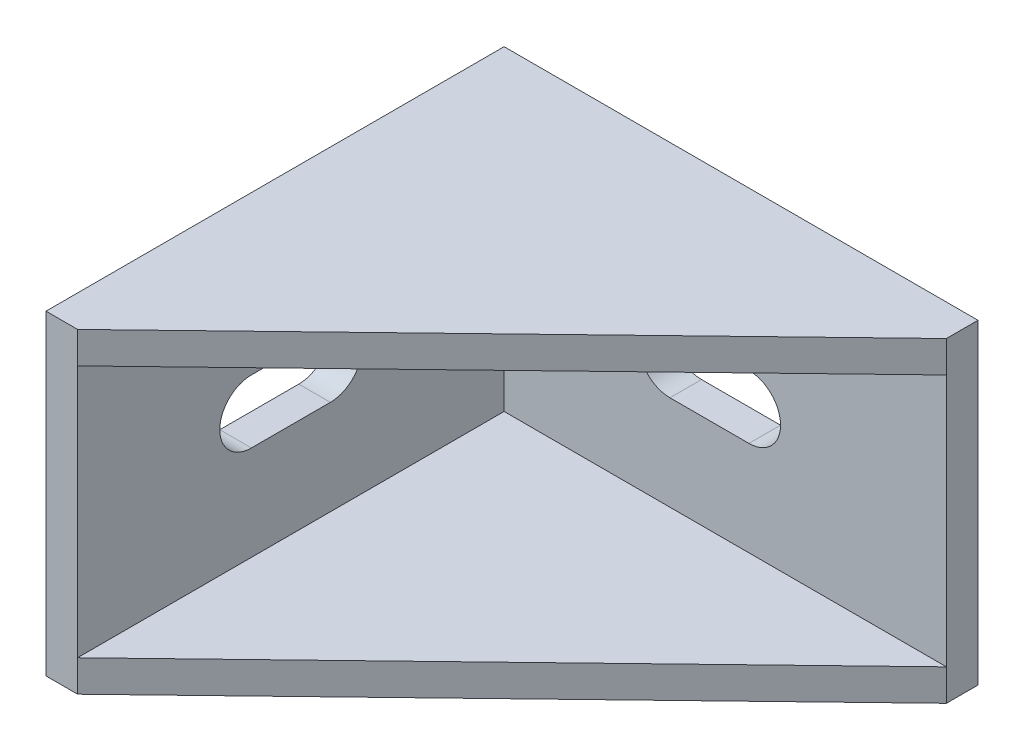
ISO-10303-21;
HEADER;
FILE_DESCRIPTION(('STEP AP214'),'2;1');
FILE_NAME('part.step','',(''),(''),'','','');
FILE_SCHEMA(('AUTOMOTIVE_DESIGN { 1 0 10303 214 1 1 1 1 }'));
ENDSEC;
DATA;
#1=APPLICATION_CONTEXT('core data for automotive mechanical design processes');
#2=APPLICATION_PROTOCOL_DEFINITION('international standard','automotive_design',2000,#1);
#3=PRODUCT_CONTEXT('',#1,'mechanical');
#4=PRODUCT('Part','Part','',(#3));
#5=PRODUCT_RELATED_PRODUCT_CATEGORY('part','',(#4));
#6=PRODUCT_DEFINITION_FORMATION('','',#4);
#7=PRODUCT_DEFINITION_CONTEXT('part definition',#1,'design');
#8=PRODUCT_DEFINITION('design','',#6,#7);
#9=PRODUCT_DEFINITION_SHAPE('','',#8);
#10=(LENGTH_UNIT() NAMED_UNIT(*) SI_UNIT(.MILLI.,.METRE.));
#11=(NAMED_UNIT(*) PLANE_ANGLE_UNIT() SI_UNIT($,.RADIAN.));
#12=(NAMED_UNIT(*) SI_UNIT($,.STERADIAN.) SOLID_ANGLE_UNIT());
#13=UNCERTAINTY_MEASURE_WITH_UNIT(LENGTH_MEASURE(1.E-05),#10,'distance_accuracy_value','');
#14=(GEOMETRIC_REPRESENTATION_CONTEXT(3) GLOBAL_UNCERTAINTY_ASSIGNED_CONTEXT((#13)) GLOBAL_UNIT_ASSIGNED_CONTEXT((#10,
#11,#12)) REPRESENTATION_CONTEXT('',''));
#15=CARTESIAN_POINT('',(0.,0.,0.));
#16=DIRECTION('',(0.,0.,1.));
#17=DIRECTION('',(1.,0.,0.));
#18=AXIS2_PLACEMENT_3D('',#15,#16,#17);
#19=CARTESIAN_POINT('',(0.,0.,0.));
#20=DIRECTION('',(0.,0.,-1.));
#21=DIRECTION('',(-1.,0.,0.));
#22=AXIS2_PLACEMENT_3D('',#19,#20,#21);
#23=PLANE('',#22);
#24=CARTESIAN_POINT('',(-2.5,0.,0.));
#25=DIRECTION('',(0.,0.,-1.));
#26=DIRECTION('',(-1.,0.,0.));
#27=AXIS2_PLACEMENT_3D('',#24,#25,#26);
#28=CIRCLE('',#27,2.);
#29=CARTESIAN_POINT('',(-2.5,-2.,0.));
#30=VERTEX_POINT('',#29);
#31=CARTESIAN_POINT('',(-2.5,2.,0.));
#32=VERTEX_POINT('',#31);
#33=EDGE_CURVE('E398',#30,#32,#28,.T.);
#34=ORIENTED_EDGE('',*,*,#33,.F.);
#35=DIRECTION('',(-1.,0.,0.));
#36=VECTOR('',#35,1.);
#37=CARTESIAN_POINT('',(0.,-2.,0.));
#38=LINE('',#37,#36);
#39=CARTESIAN_POINT('',(2.5,-2.,0.));
#40=VERTEX_POINT('',#39);
#41=EDGE_CURVE('E391',#40,#30,#38,.T.);
#42=ORIENTED_EDGE('',*,*,#41,.F.);
#43=CARTESIAN_POINT('',(2.5,0.,0.));
#44=DIRECTION('',(0.,0.,-1.));
#45=DIRECTION('',(-1.,0.,0.));
#46=AXIS2_PLACEMENT_3D('',#43,#44,#45);
#47=CIRCLE('',#46,2.);
#48=CARTESIAN_POINT('',(2.5,2.,0.));
#49=VERTEX_POINT('',#48);
#50=EDGE_CURVE('E393',#49,#40,#47,.T.);
#51=ORIENTED_EDGE('',*,*,#50,.F.);
#52=DIRECTION('',(1.,0.,0.));
#53=VECTOR('',#52,1.);
#54=CARTESIAN_POINT('',(0.,2.,0.));
#55=LINE('',#54,#53);
#56=EDGE_CURVE('E396',#32,#49,#55,.T.);
#57=ORIENTED_EDGE('',*,*,#56,.F.);
#58=EDGE_LOOP('',(#34,#42,#51,#57));
#59=FACE_BOUND('',#58,.T.);
#60=DIRECTION('',(0.,1.,0.));
#61=VECTOR('',#60,1.);
#62=CARTESIAN_POINT('',(15.,-10.,0.));
#63=LINE('',#62,#61);
#64=CARTESIAN_POINT('',(15.,-10.,0.));
#65=VERTEX_POINT('',#64);
#66=CARTESIAN_POINT('',(15.,10.,0.));
#67=VERTEX_POINT('',#66);
#68=EDGE_CURVE('E365',#65,#67,#63,.T.);
#69=ORIENTED_EDGE('',*,*,#68,.F.);
#70=DIRECTION('',(1.,0.,0.));
#71=VECTOR('',#70,1.);
#72=CARTESIAN_POINT('',(-15.,-10.,0.));
#73=LINE('',#72,#71);
#74=CARTESIAN_POINT('',(-15.,-10.,0.));
#75=VERTEX_POINT('',#74);
#76=EDGE_CURVE('E378',#75,#65,#73,.T.);
#77=ORIENTED_EDGE('',*,*,#76,.F.);
#78=DIRECTION('',(0.,-1.,0.));
#79=VECTOR('',#78,1.);
#80=CARTESIAN_POINT('',(-15.,-10.,0.));
#81=LINE('',#80,#79);
#82=CARTESIAN_POINT('',(-15.,10.,0.));
#83=VERTEX_POINT('',#82);
#84=EDGE_CURVE('E376',#83,#75,#81,.T.);
#85=ORIENTED_EDGE('',*,*,#84,.F.);
#86=DIRECTION('',(-1.,0.,0.));
#87=VECTOR('',#86,1.);
#88=CARTESIAN_POINT('',(-15.,10.,0.));
#89=LINE('',#88,#87);
#90=EDGE_CURVE('E374',#67,#83,#89,.T.);
#91=ORIENTED_EDGE('',*,*,#90,.F.);
#92=EDGE_LOOP('',(#69,#77,#85,#91));
#93=FACE_BOUND('',#92,.T.);
#94=DIRECTION('',(0.,1.,0.));
#95=VECTOR('',#94,1.);
#96=CARTESIAN_POINT('',(7.75,-1.,0.));
#97=LINE('',#96,#95);
#98=CARTESIAN_POINT('',(7.75,-1.,0.));
#99=VERTEX_POINT('',#98);
#100=CARTESIAN_POINT('',(7.75,1.,0.));
#101=VERTEX_POINT('',#100);
#102=EDGE_CURVE('E255',#99,#101,#97,.T.);
#103=ORIENTED_EDGE('',*,*,#102,.F.);
#104=CARTESIAN_POINT('',(9.75,-1.,0.));
#105=DIRECTION('',(0.,0.,-1.));
#106=DIRECTION('',(-1.,0.,0.));
#107=AXIS2_PLACEMENT_3D('',#104,#105,#106);
#108=CIRCLE('',#107,2.);
#109=CARTESIAN_POINT('',(11.75,-1.,0.));
#110=VERTEX_POINT('',#109);
#111=EDGE_CURVE('E230',#110,#99,#108,.T.);
#112=ORIENTED_EDGE('',*,*,#111,.F.);
#113=DIRECTION('',(0.,-1.,0.));
#114=VECTOR('',#113,1.);
#115=CARTESIAN_POINT('',(11.75,-1.,0.));
#116=LINE('',#115,#114);
#117=CARTESIAN_POINT('',(11.75,0.999999999999999,0.));
#118=VERTEX_POINT('',#117);
#119=EDGE_CURVE('E261',#118,#110,#116,.T.);
#120=ORIENTED_EDGE('',*,*,#119,.F.);
#121=CARTESIAN_POINT('',(9.75,1.,0.));
#122=DIRECTION('',(0.,0.,-1.));
#123=DIRECTION('',(-1.,0.,0.));
#124=AXIS2_PLACEMENT_3D('',#121,#122,#123);
#125=CIRCLE('',#124,2.);
#126=EDGE_CURVE('E258',#101,#118,#125,.T.);
#127=ORIENTED_EDGE('',*,*,#126,.F.);
#128=EDGE_LOOP('',(#103,#112,#120,#127));
#129=FACE_BOUND('',#128,.T.);
#130=DIRECTION('',(0.,1.,0.));
#131=VECTOR('',#130,1.);
#132=CARTESIAN_POINT('',(-11.75,-1.,0.));
#133=LINE('',#132,#131);
#134=CARTESIAN_POINT('',(-11.75,-1.,0.));
#135=VERTEX_POINT('',#134);
#136=CARTESIAN_POINT('',(-11.75,1.,0.));
#137=VERTEX_POINT('',#136);
#138=EDGE_CURVE('E226',#135,#137,#133,.T.);
#139=ORIENTED_EDGE('',*,*,#138,.F.);
#140=CARTESIAN_POINT('',(-9.75,-1.,0.));
#141=DIRECTION('',(0.,0.,-1.));
#142=DIRECTION('',(-1.,0.,0.));
#143=AXIS2_PLACEMENT_3D('',#140,#141,#142);
#144=CIRCLE('',#143,2.);
#145=CARTESIAN_POINT('',(-7.75,-1.,0.));
#146=VERTEX_POINT('',#145);
#147=EDGE_CURVE('E234',#146,#135,#144,.T.);
#148=ORIENTED_EDGE('',*,*,#147,.F.);
#149=DIRECTION('',(0.,-1.,0.));
#150=VECTOR('',#149,1.);
#151=CARTESIAN_POINT('',(-7.75,-1.,0.));
#152=LINE('',#151,#150);
#153=CARTESIAN_POINT('',(-7.75,1.,0.));
#154=VERTEX_POINT('',#153);
#155=EDGE_CURVE('E245',#154,#146,#152,.T.);
#156=ORIENTED_EDGE('',*,*,#155,.F.);
#157=CARTESIAN_POINT('',(-9.75,1.,0.));
#158=DIRECTION('',(0.,0.,-1.));
#159=DIRECTION('',(-1.,0.,0.));
#160=AXIS2_PLACEMENT_3D('',#157,#158,#159);
#161=CIRCLE('',#160,2.);
#162=EDGE_CURVE('E243',#137,#154,#161,.T.);
#163=ORIENTED_EDGE('',*,*,#162,.F.);
#164=EDGE_LOOP('',(#139,#148,#156,#163));
#165=FACE_BOUND('',#164,.T.);
#166=ADVANCED_FACE('F35',(#59,#93,#129,#165),#23,.T.);
#167=CARTESIAN_POINT('',(0.,0.,2.));
#168=DIRECTION('',(0.,0.,-1.));
#169=DIRECTION('',(-1.,0.,0.));
#170=AXIS2_PLACEMENT_3D('',#167,#168,#169);
#171=PLANE('',#170);
#172=DIRECTION('',(1.,0.,0.));
#173=VECTOR('',#172,1.);
#174=CARTESIAN_POINT('',(-2.5,-2.,2.));
#175=LINE('',#174,#173);
#176=CARTESIAN_POINT('',(-2.5,-2.,2.));
#177=VERTEX_POINT('',#176);
#178=CARTESIAN_POINT('',(2.5,-2.,2.));
#179=VERTEX_POINT('',#178);
#180=EDGE_CURVE('E334',#177,#179,#175,.T.);
#181=ORIENTED_EDGE('',*,*,#180,.F.);
#182=CARTESIAN_POINT('',(-2.5,0.,2.));
#183=DIRECTION('',(0.,0.,1.));
#184=DIRECTION('',(1.,0.,0.));
#185=AXIS2_PLACEMENT_3D('',#182,#183,#184);
#186=CIRCLE('',#185,2.);
#187=CARTESIAN_POINT('',(-2.5,2.,2.));
#188=VERTEX_POINT('',#187);
#189=EDGE_CURVE('E332',#188,#177,#186,.T.);
#190=ORIENTED_EDGE('',*,*,#189,.F.);
#191=DIRECTION('',(-1.,0.,0.));
#192=VECTOR('',#191,1.);
#193=CARTESIAN_POINT('',(-2.5,2.,2.));
#194=LINE('',#193,#192);
#195=CARTESIAN_POINT('',(2.5,2.,2.));
#196=VERTEX_POINT('',#195);
#197=EDGE_CURVE('E340',#196,#188,#194,.T.);
#198=ORIENTED_EDGE('',*,*,#197,.F.);
#199=CARTESIAN_POINT('',(2.5,0.,2.));
#200=DIRECTION('',(0.,0.,1.));
#201=DIRECTION('',(1.,0.,0.));
#202=AXIS2_PLACEMENT_3D('',#199,#200,#201);
#203=CIRCLE('',#202,2.);
#204=EDGE_CURVE('E337',#179,#196,#203,.T.);
#205=ORIENTED_EDGE('',*,*,#204,.F.);
#206=EDGE_LOOP('',(#181,#190,#198,#205));
#207=FACE_BOUND('',#206,.T.);
#208=DIRECTION('',(-1.,0.,0.));
#209=VECTOR('',#208,1.);
#210=CARTESIAN_POINT('',(-13.,8.,2.));
#211=LINE('',#210,#209);
#212=CARTESIAN_POINT('',(15.,8.,2.));
#213=VERTEX_POINT('',#212);
#214=CARTESIAN_POINT('',(-13.,8.,2.));
#215=VERTEX_POINT('',#214);
#216=EDGE_CURVE('E273',#213,#215,#211,.T.);
#217=ORIENTED_EDGE('',*,*,#216,.T.);
#218=DIRECTION('',(0.,-1.,0.));
#219=VECTOR('',#218,1.);
#220=CARTESIAN_POINT('',(-13.,0.,2.));
#221=LINE('',#220,#219);
#222=CARTESIAN_POINT('',(-13.,-8.,2.));
#223=VERTEX_POINT('',#222);
#224=EDGE_CURVE('E346',#215,#223,#221,.T.);
#225=ORIENTED_EDGE('',*,*,#224,.T.);
#226=DIRECTION('',(1.,0.,0.));
#227=VECTOR('',#226,1.);
#228=CARTESIAN_POINT('',(-13.,-8.,2.));
#229=LINE('',#228,#227);
#230=CARTESIAN_POINT('',(15.,-8.,2.));
#231=VERTEX_POINT('',#230);
#232=EDGE_CURVE('E290',#223,#231,#229,.T.);
#233=ORIENTED_EDGE('',*,*,#232,.T.);
#234=DIRECTION('',(0.,1.,0.));
#235=VECTOR('',#234,1.);
#236=CARTESIAN_POINT('',(15.,-10.,2.));
#237=LINE('',#236,#235);
#238=EDGE_CURVE('E371',#231,#213,#237,.T.);
#239=ORIENTED_EDGE('',*,*,#238,.T.);
#240=EDGE_LOOP('',(#217,#225,#233,#239));
#241=FACE_BOUND('',#240,.T.);
#242=ADVANCED_FACE('F478',(#207,#241),#171,.F.);
#243=CARTESIAN_POINT('',(-13.,0.,29.));
#244=DIRECTION('',(1.,0.,0.));
#245=DIRECTION('',(0.,1.,0.));
#246=AXIS2_PLACEMENT_3D('',#243,#244,#245);
#247=PLANE('',#246);
#248=CARTESIAN_POINT('',(-13.,0.,18.));
#249=DIRECTION('',(1.,0.,0.));
#250=DIRECTION('',(0.,1.,0.));
#251=AXIS2_PLACEMENT_3D('',#248,#249,#250);
#252=CIRCLE('',#251,2.);
#253=CARTESIAN_POINT('',(-13.,2.,18.));
#254=VERTEX_POINT('',#253);
#255=CARTESIAN_POINT('',(-13.,-2.,18.));
#256=VERTEX_POINT('',#255);
#257=EDGE_CURVE('E300',#254,#256,#252,.T.);
#258=ORIENTED_EDGE('',*,*,#257,.F.);
#259=DIRECTION('',(0.,0.,1.));
#260=VECTOR('',#259,1.);
#261=CARTESIAN_POINT('',(-13.,2.,18.));
#262=LINE('',#261,#260);
#263=CARTESIAN_POINT('',(-13.,2.,13.));
#264=VERTEX_POINT('',#263);
#265=EDGE_CURVE('E308',#264,#254,#262,.T.);
#266=ORIENTED_EDGE('',*,*,#265,.F.);
#267=CARTESIAN_POINT('',(-13.,0.,13.));
#268=DIRECTION('',(1.,0.,0.));
#269=DIRECTION('',(0.,1.,0.));
#270=AXIS2_PLACEMENT_3D('',#267,#268,#269);
#271=CIRCLE('',#270,2.);
#272=CARTESIAN_POINT('',(-13.,-2.,13.));
#273=VERTEX_POINT('',#272);
#274=EDGE_CURVE('E305',#273,#264,#271,.T.);
#275=ORIENTED_EDGE('',*,*,#274,.F.);
#276=DIRECTION('',(0.,0.,-1.));
#277=VECTOR('',#276,1.);
#278=CARTESIAN_POINT('',(-13.,-2.,18.));
#279=LINE('',#278,#277);
#280=EDGE_CURVE('E302',#256,#273,#279,.T.);
#281=ORIENTED_EDGE('',*,*,#280,.F.);
#282=EDGE_LOOP('',(#258,#266,#275,#281));
#283=FACE_BOUND('',#282,.T.);
#284=ORIENTED_EDGE('',*,*,#224,.F.);
#285=DIRECTION('',(0.,0.,1.));
#286=VECTOR('',#285,1.);
#287=CARTESIAN_POINT('',(-13.,8.,29.));
#288=LINE('',#287,#286);
#289=CARTESIAN_POINT('',(-13.,8.,29.));
#290=VERTEX_POINT('',#289);
#291=EDGE_CURVE('E275',#215,#290,#288,.T.);
#292=ORIENTED_EDGE('',*,*,#291,.T.);
#293=DIRECTION('',(0.,-1.,0.));
#294=VECTOR('',#293,1.);
#295=CARTESIAN_POINT('',(-13.,0.,29.));
#296=LINE('',#295,#294);
#297=CARTESIAN_POINT('',(-13.,-8.,29.));
#298=VERTEX_POINT('',#297);
#299=EDGE_CURVE('E357',#290,#298,#296,.T.);
#300=ORIENTED_EDGE('',*,*,#299,.T.);
#301=DIRECTION('',(0.,0.,-1.));
#302=VECTOR('',#301,1.);
#303=CARTESIAN_POINT('',(-13.,-8.,29.));
#304=LINE('',#303,#302);
#305=EDGE_CURVE('E287',#298,#223,#304,.T.);
#306=ORIENTED_EDGE('',*,*,#305,.T.);
#307=EDGE_LOOP('',(#284,#292,#300,#306));
#308=FACE_BOUND('',#307,.T.);
#309=ADVANCED_FACE('F484',(#283,#308),#247,.T.);
#310=CARTESIAN_POINT('',(15.,-10.,2.));
#311=DIRECTION('',(-1.,0.,0.));
#312=DIRECTION('',(0.,0.,1.));
#313=AXIS2_PLACEMENT_3D('',#310,#311,#312);
#314=PLANE('',#313);
#315=ORIENTED_EDGE('',*,*,#68,.T.);
#316=DIRECTION('',(0.,0.,-1.));
#317=VECTOR('',#316,1.);
#318=CARTESIAN_POINT('',(15.,10.,2.));
#319=LINE('',#318,#317);
#320=CARTESIAN_POINT('',(15.,10.,2.));
#321=VERTEX_POINT('',#320);
#322=EDGE_CURVE('E388',#321,#67,#319,.T.);
#323=ORIENTED_EDGE('',*,*,#322,.F.);
#324=DIRECTION('',(0.,1.,0.));
#325=VECTOR('',#324,1.);
#326=CARTESIAN_POINT('',(15.,8.,2.));
#327=LINE('',#326,#325);
#328=EDGE_CURVE('E281',#213,#321,#327,.T.);
#329=ORIENTED_EDGE('',*,*,#328,.F.);
#330=ORIENTED_EDGE('',*,*,#238,.F.);
#331=CARTESIAN_POINT('',(15.,-10.,2.));
#332=VERTEX_POINT('',#331);
#333=EDGE_CURVE('E367',#332,#231,#237,.T.);
#334=ORIENTED_EDGE('',*,*,#333,.F.);
#335=DIRECTION('',(0.,0.,-1.));
#336=VECTOR('',#335,1.);
#337=CARTESIAN_POINT('',(15.,-10.,2.));
#338=LINE('',#337,#336);
#339=EDGE_CURVE('E370',#332,#65,#338,.T.);
#340=ORIENTED_EDGE('',*,*,#339,.T.);
#341=EDGE_LOOP('',(#315,#323,#329,#330,#334,#340));
#342=FACE_BOUND('',#341,.T.);
#343=ADVANCED_FACE('F503',(#342),#314,.F.);
#344=CARTESIAN_POINT('',(-15.,10.,2.));
#345=DIRECTION('',(0.,-1.,0.));
#346=DIRECTION('',(0.,0.,-1.));
#347=AXIS2_PLACEMENT_3D('',#344,#345,#346);
#348=PLANE('',#347);
#349=ORIENTED_EDGE('',*,*,#90,.T.);
#350=DIRECTION('',(0.,0.,-1.));
#351=VECTOR('',#350,1.);
#352=CARTESIAN_POINT('',(-15.,10.,2.));
#353=LINE('',#352,#351);
#354=CARTESIAN_POINT('',(-15.,10.,29.));
#355=VERTEX_POINT('',#354);
#356=EDGE_CURVE('E385',#355,#83,#353,.T.);
#357=ORIENTED_EDGE('',*,*,#356,.F.);
#358=DIRECTION('',(-1.,0.,0.));
#359=VECTOR('',#358,1.);
#360=CARTESIAN_POINT('',(0.,10.,29.));
#361=LINE('',#360,#359);
#362=CARTESIAN_POINT('',(-13.,10.,29.));
#363=VERTEX_POINT('',#362);
#364=EDGE_CURVE('E356',#363,#355,#361,.T.);
#365=ORIENTED_EDGE('',*,*,#364,.F.);
#366=DIRECTION('',(0.719844295420685,0.,-0.694135570584232));
#367=VECTOR('',#366,1.);
#368=CARTESIAN_POINT('',(15.,10.,2.));
#369=LINE('',#368,#367);
#370=EDGE_CURVE('E272',#363,#321,#369,.T.);
#371=ORIENTED_EDGE('',*,*,#370,.T.);
#372=ORIENTED_EDGE('',*,*,#322,.T.);
#373=EDGE_LOOP('',(#349,#357,#365,#371,#372));
#374=FACE_BOUND('',#373,.T.);
#375=ADVANCED_FACE('F499',(#374),#348,.F.);
#376=CARTESIAN_POINT('',(-15.,-10.,2.));
#377=DIRECTION('',(1.,0.,0.));
#378=DIRECTION('',(0.,0.,-1.));
#379=AXIS2_PLACEMENT_3D('',#376,#377,#378);
#380=PLANE('',#379);
#381=DIRECTION('',(0.,0.,1.));
#382=VECTOR('',#381,1.);
#383=CARTESIAN_POINT('',(-15.,2.,2.));
#384=LINE('',#383,#382);
#385=CARTESIAN_POINT('',(-15.,2.,13.));
#386=VERTEX_POINT('',#385);
#387=CARTESIAN_POINT('',(-15.,2.,18.));
#388=VERTEX_POINT('',#387);
#389=EDGE_CURVE('E326',#386,#388,#384,.T.);
#390=ORIENTED_EDGE('',*,*,#389,.T.);
#391=CARTESIAN_POINT('',(-15.,0.,18.));
#392=DIRECTION('',(1.,0.,0.));
#393=DIRECTION('',(0.,0.,-1.));
#394=AXIS2_PLACEMENT_3D('',#391,#392,#393);
#395=CIRCLE('',#394,2.);
#396=CARTESIAN_POINT('',(-15.,-2.,18.));
#397=VERTEX_POINT('',#396);
#398=EDGE_CURVE('E329',#388,#397,#395,.T.);
#399=ORIENTED_EDGE('',*,*,#398,.T.);
#400=DIRECTION('',(0.,0.,-1.));
#401=VECTOR('',#400,1.);
#402=CARTESIAN_POINT('',(-15.,-2.,2.));
#403=LINE('',#402,#401);
#404=CARTESIAN_POINT('',(-15.,-2.,13.));
#405=VERTEX_POINT('',#404);
#406=EDGE_CURVE('E314',#397,#405,#403,.T.);
#407=ORIENTED_EDGE('',*,*,#406,.T.);
#408=CARTESIAN_POINT('',(-15.,0.,13.));
#409=DIRECTION('',(1.,0.,0.));
#410=DIRECTION('',(0.,0.,-1.));
#411=AXIS2_PLACEMENT_3D('',#408,#409,#410);
#412=CIRCLE('',#411,2.);
#413=EDGE_CURVE('E323',#405,#386,#412,.T.);
#414=ORIENTED_EDGE('',*,*,#413,.T.);
#415=EDGE_LOOP('',(#390,#399,#407,#414));
#416=FACE_BOUND('',#415,.T.);
#417=ORIENTED_EDGE('',*,*,#84,.T.);
#418=DIRECTION('',(0.,0.,-1.));
#419=VECTOR('',#418,1.);
#420=CARTESIAN_POINT('',(-15.,-10.,2.));
#421=LINE('',#420,#419);
#422=CARTESIAN_POINT('',(-15.,-10.,29.));
#423=VERTEX_POINT('',#422);
#424=EDGE_CURVE('E382',#423,#75,#421,.T.);
#425=ORIENTED_EDGE('',*,*,#424,.F.);
#426=DIRECTION('',(0.,-1.,0.));
#427=VECTOR('',#426,1.);
#428=CARTESIAN_POINT('',(-15.,0.,29.));
#429=LINE('',#428,#427);
#430=EDGE_CURVE('E360',#355,#423,#429,.T.);
#431=ORIENTED_EDGE('',*,*,#430,.F.);
#432=ORIENTED_EDGE('',*,*,#356,.T.);
#433=EDGE_LOOP('',(#417,#425,#431,#432));
#434=FACE_BOUND('',#433,.T.);
#435=ADVANCED_FACE('F495',(#416,#434),#380,.F.);
#436=CARTESIAN_POINT('',(-15.,-10.,2.));
#437=DIRECTION('',(0.,1.,0.));
#438=DIRECTION('',(0.,0.,1.));
#439=AXIS2_PLACEMENT_3D('',#436,#437,#438);
#440=PLANE('',#439);
#441=ORIENTED_EDGE('',*,*,#339,.F.);
#442=DIRECTION('',(-0.719844295420685,0.,0.694135570584232));
#443=VECTOR('',#442,1.);
#444=CARTESIAN_POINT('',(-13.,-10.,29.));
#445=LINE('',#444,#443);
#446=CARTESIAN_POINT('',(-13.,-10.,29.));
#447=VERTEX_POINT('',#446);
#448=EDGE_CURVE('E286',#332,#447,#445,.T.);
#449=ORIENTED_EDGE('',*,*,#448,.T.);
#450=DIRECTION('',(1.,0.,0.));
#451=VECTOR('',#450,1.);
#452=CARTESIAN_POINT('',(0.,-10.,29.));
#453=LINE('',#452,#451);
#454=EDGE_CURVE('E363',#423,#447,#453,.T.);
#455=ORIENTED_EDGE('',*,*,#454,.F.);
#456=ORIENTED_EDGE('',*,*,#424,.T.);
#457=ORIENTED_EDGE('',*,*,#76,.T.);
#458=EDGE_LOOP('',(#441,#449,#455,#456,#457));
#459=FACE_BOUND('',#458,.T.);
#460=ADVANCED_FACE('F491',(#459),#440,.F.);
#461=CARTESIAN_POINT('',(0.,0.,29.));
#462=DIRECTION('',(0.,0.,1.));
#463=DIRECTION('',(1.,0.,0.));
#464=AXIS2_PLACEMENT_3D('',#461,#462,#463);
#465=PLANE('',#464);
#466=EDGE_CURVE('E353',#363,#290,#296,.T.);
#467=ORIENTED_EDGE('',*,*,#466,.F.);
#468=ORIENTED_EDGE('',*,*,#364,.T.);
#469=ORIENTED_EDGE('',*,*,#430,.T.);
#470=ORIENTED_EDGE('',*,*,#454,.T.);
#471=DIRECTION('',(0.,-1.,0.));
#472=VECTOR('',#471,1.);
#473=CARTESIAN_POINT('',(-13.,-8.,29.));
#474=LINE('',#473,#472);
#475=EDGE_CURVE('E295',#298,#447,#474,.T.);
#476=ORIENTED_EDGE('',*,*,#475,.F.);
#477=ORIENTED_EDGE('',*,*,#299,.F.);
#478=EDGE_LOOP('',(#467,#468,#469,#470,#476,#477));
#479=FACE_BOUND('',#478,.T.);
#480=ADVANCED_FACE('F494',(#479),#465,.T.);
#481=CARTESIAN_POINT('',(-2.5,0.,-25.));
#482=DIRECTION('',(0.,0.,1.));
#483=DIRECTION('',(1.,0.,0.));
#484=AXIS2_PLACEMENT_3D('',#481,#482,#483);
#485=CYLINDRICAL_SURFACE('',#484,2.);
#486=ORIENTED_EDGE('',*,*,#33,.T.);
#487=DIRECTION('',(0.,0.,1.));
#488=VECTOR('',#487,1.);
#489=CARTESIAN_POINT('',(-2.5,2.,-25.));
#490=LINE('',#489,#488);
#491=EDGE_CURVE('E344',#32,#188,#490,.T.);
#492=ORIENTED_EDGE('',*,*,#491,.T.);
#493=ORIENTED_EDGE('',*,*,#189,.T.);
#494=DIRECTION('',(0.,0.,1.));
#495=VECTOR('',#494,1.);
#496=CARTESIAN_POINT('',(-2.5,-2.,-25.));
#497=LINE('',#496,#495);
#498=EDGE_CURVE('E343',#30,#177,#497,.T.);
#499=ORIENTED_EDGE('',*,*,#498,.F.);
#500=EDGE_LOOP('',(#486,#492,#493,#499));
#501=FACE_BOUND('',#500,.T.);
#502=ADVANCED_FACE('F634',(#501),#485,.F.);
#503=CARTESIAN_POINT('',(-2.5,2.,-25.));
#504=DIRECTION('',(0.,1.,0.));
#505=DIRECTION('',(0.,0.,1.));
#506=AXIS2_PLACEMENT_3D('',#503,#504,#505);
#507=PLANE('',#506);
#508=ORIENTED_EDGE('',*,*,#56,.T.);
#509=DIRECTION('',(0.,0.,1.));
#510=VECTOR('',#509,1.);
#511=CARTESIAN_POINT('',(2.5,2.,-25.));
#512=LINE('',#511,#510);
#513=EDGE_CURVE('E347',#49,#196,#512,.T.);
#514=ORIENTED_EDGE('',*,*,#513,.T.);
#515=ORIENTED_EDGE('',*,*,#197,.T.);
#516=ORIENTED_EDGE('',*,*,#491,.F.);
#517=EDGE_LOOP('',(#508,#514,#515,#516));
#518=FACE_BOUND('',#517,.T.);
#519=ADVANCED_FACE('F757',(#518),#507,.F.);
#520=CARTESIAN_POINT('',(2.5,0.,-25.));
#521=DIRECTION('',(0.,0.,1.));
#522=DIRECTION('',(1.,0.,0.));
#523=AXIS2_PLACEMENT_3D('',#520,#521,#522);
#524=CYLINDRICAL_SURFACE('',#523,2.);
#525=ORIENTED_EDGE('',*,*,#50,.T.);
#526=DIRECTION('',(0.,0.,1.));
#527=VECTOR('',#526,1.);
#528=CARTESIAN_POINT('',(2.5,-2.,-25.));
#529=LINE('',#528,#527);
#530=EDGE_CURVE('E349',#40,#179,#529,.T.);
#531=ORIENTED_EDGE('',*,*,#530,.T.);
#532=ORIENTED_EDGE('',*,*,#204,.T.);
#533=ORIENTED_EDGE('',*,*,#513,.F.);
#534=EDGE_LOOP('',(#525,#531,#532,#533));
#535=FACE_BOUND('',#534,.T.);
#536=ADVANCED_FACE('F747',(#535),#524,.F.);
#537=CARTESIAN_POINT('',(-2.5,-2.,-25.));
#538=DIRECTION('',(0.,-1.,0.));
#539=DIRECTION('',(0.,0.,-1.));
#540=AXIS2_PLACEMENT_3D('',#537,#538,#539);
#541=PLANE('',#540);
#542=ORIENTED_EDGE('',*,*,#41,.T.);
#543=ORIENTED_EDGE('',*,*,#498,.T.);
#544=ORIENTED_EDGE('',*,*,#180,.T.);
#545=ORIENTED_EDGE('',*,*,#530,.F.);
#546=EDGE_LOOP('',(#542,#543,#544,#545));
#547=FACE_BOUND('',#546,.T.);
#548=ADVANCED_FACE('F729',(#547),#541,.F.);
#549=CARTESIAN_POINT('',(-40.,0.,18.));
#550=DIRECTION('',(1.,0.,0.));
#551=DIRECTION('',(0.,1.,0.));
#552=AXIS2_PLACEMENT_3D('',#549,#550,#551);
#553=CYLINDRICAL_SURFACE('',#552,2.);
#554=DIRECTION('',(1.,0.,0.));
#555=VECTOR('',#554,1.);
#556=CARTESIAN_POINT('',(-40.,1.99999999999999,18.));
#557=LINE('',#556,#555);
#558=EDGE_CURVE('E312',#388,#254,#557,.T.);
#559=ORIENTED_EDGE('',*,*,#558,.T.);
#560=ORIENTED_EDGE('',*,*,#257,.T.);
#561=DIRECTION('',(1.,0.,0.));
#562=VECTOR('',#561,1.);
#563=CARTESIAN_POINT('',(-40.,-2.00000000000001,18.));
#564=LINE('',#563,#562);
#565=EDGE_CURVE('E311',#397,#256,#564,.T.);
#566=ORIENTED_EDGE('',*,*,#565,.F.);
#567=ORIENTED_EDGE('',*,*,#398,.F.);
#568=EDGE_LOOP('',(#559,#560,#566,#567));
#569=FACE_BOUND('',#568,.T.);
#570=ADVANCED_FACE('F719',(#569),#553,.F.);
#571=CARTESIAN_POINT('',(-40.,1.99999999999999,18.));
#572=DIRECTION('',(0.,1.,0.));
#573=DIRECTION('',(0.,0.,1.));
#574=AXIS2_PLACEMENT_3D('',#571,#572,#573);
#575=PLANE('',#574);
#576=DIRECTION('',(1.,0.,0.));
#577=VECTOR('',#576,1.);
#578=CARTESIAN_POINT('',(-40.,1.99999999999999,13.));
#579=LINE('',#578,#577);
#580=EDGE_CURVE('E315',#386,#264,#579,.T.);
#581=ORIENTED_EDGE('',*,*,#580,.T.);
#582=ORIENTED_EDGE('',*,*,#265,.T.);
#583=ORIENTED_EDGE('',*,*,#558,.F.);
#584=ORIENTED_EDGE('',*,*,#389,.F.);
#585=EDGE_LOOP('',(#581,#582,#583,#584));
#586=FACE_BOUND('',#585,.T.);
#587=ADVANCED_FACE('F709',(#586),#575,.F.);
#588=CARTESIAN_POINT('',(-40.,0.,13.));
#589=DIRECTION('',(1.,0.,0.));
#590=DIRECTION('',(0.,1.,0.));
#591=AXIS2_PLACEMENT_3D('',#588,#589,#590);
#592=CYLINDRICAL_SURFACE('',#591,2.);
#593=DIRECTION('',(1.,0.,0.));
#594=VECTOR('',#593,1.);
#595=CARTESIAN_POINT('',(-40.,-2.00000000000001,13.));
#596=LINE('',#595,#594);
#597=EDGE_CURVE('E317',#405,#273,#596,.T.);
#598=ORIENTED_EDGE('',*,*,#597,.T.);
#599=ORIENTED_EDGE('',*,*,#274,.T.);
#600=ORIENTED_EDGE('',*,*,#580,.F.);
#601=ORIENTED_EDGE('',*,*,#413,.F.);
#602=EDGE_LOOP('',(#598,#599,#600,#601));
#603=FACE_BOUND('',#602,.T.);
#604=ADVANCED_FACE('F699',(#603),#592,.F.);
#605=CARTESIAN_POINT('',(-40.,-2.00000000000001,18.));
#606=DIRECTION('',(0.,-1.,0.));
#607=DIRECTION('',(0.,0.,-1.));
#608=AXIS2_PLACEMENT_3D('',#605,#606,#607);
#609=PLANE('',#608);
#610=ORIENTED_EDGE('',*,*,#565,.T.);
#611=ORIENTED_EDGE('',*,*,#280,.T.);
#612=ORIENTED_EDGE('',*,*,#597,.F.);
#613=ORIENTED_EDGE('',*,*,#406,.F.);
#614=EDGE_LOOP('',(#610,#611,#612,#613));
#615=FACE_BOUND('',#614,.T.);
#616=ADVANCED_FACE('F683',(#615),#609,.F.);
#617=CARTESIAN_POINT('',(-13.,-8.,29.));
#618=DIRECTION('',(0.694135570584232,0.,0.719844295420685));
#619=DIRECTION('',(0.719844295420685,0.,-0.694135570584232));
#620=AXIS2_PLACEMENT_3D('',#617,#618,#619);
#621=PLANE('',#620);
#622=ORIENTED_EDGE('',*,*,#448,.F.);
#623=ORIENTED_EDGE('',*,*,#333,.T.);
#624=DIRECTION('',(-0.719844295420685,0.,0.694135570584232));
#625=VECTOR('',#624,1.);
#626=CARTESIAN_POINT('',(-13.,-8.,29.));
#627=LINE('',#626,#625);
#628=EDGE_CURVE('E292',#231,#298,#627,.T.);
#629=ORIENTED_EDGE('',*,*,#628,.T.);
#630=ORIENTED_EDGE('',*,*,#475,.T.);
#631=EDGE_LOOP('',(#622,#623,#629,#630));
#632=FACE_BOUND('',#631,.T.);
#633=ADVANCED_FACE('F673',(#632),#621,.T.);
#634=CARTESIAN_POINT('',(0.,-8.,0.));
#635=DIRECTION('',(0.,-1.,0.));
#636=DIRECTION('',(0.,0.,-1.));
#637=AXIS2_PLACEMENT_3D('',#634,#635,#636);
#638=PLANE('',#637);
#639=ORIENTED_EDGE('',*,*,#305,.F.);
#640=ORIENTED_EDGE('',*,*,#628,.F.);
#641=ORIENTED_EDGE('',*,*,#232,.F.);
#642=EDGE_LOOP('',(#639,#640,#641));
#643=FACE_BOUND('',#642,.T.);
#644=ADVANCED_FACE('F622',(#643),#638,.F.);
#645=CARTESIAN_POINT('',(15.,8.,2.));
#646=DIRECTION('',(0.694135570584232,0.,0.719844295420685));
#647=DIRECTION('',(0.719844295420685,0.,-0.694135570584232));
#648=AXIS2_PLACEMENT_3D('',#645,#646,#647);
#649=PLANE('',#648);
#650=ORIENTED_EDGE('',*,*,#370,.F.);
#651=ORIENTED_EDGE('',*,*,#466,.T.);
#652=DIRECTION('',(0.719844295420685,0.,-0.694135570584232));
#653=VECTOR('',#652,1.);
#654=CARTESIAN_POINT('',(15.,8.,2.));
#655=LINE('',#654,#653);
#656=EDGE_CURVE('E278',#290,#213,#655,.T.);
#657=ORIENTED_EDGE('',*,*,#656,.T.);
#658=ORIENTED_EDGE('',*,*,#328,.T.);
#659=EDGE_LOOP('',(#650,#651,#657,#658));
#660=FACE_BOUND('',#659,.T.);
#661=ADVANCED_FACE('F612',(#660),#649,.T.);
#662=CARTESIAN_POINT('',(0.,8.,0.));
#663=DIRECTION('',(0.,1.,0.));
#664=DIRECTION('',(0.,0.,1.));
#665=AXIS2_PLACEMENT_3D('',#662,#663,#664);
#666=PLANE('',#665);
#667=ORIENTED_EDGE('',*,*,#216,.F.);
#668=ORIENTED_EDGE('',*,*,#656,.F.);
#669=ORIENTED_EDGE('',*,*,#291,.F.);
#670=EDGE_LOOP('',(#667,#668,#669));
#671=FACE_BOUND('',#670,.T.);
#672=ADVANCED_FACE('F597',(#671),#666,.F.);
#673=CARTESIAN_POINT('',(9.75,-1.,-3.));
#674=DIRECTION('',(0.,0.,1.));
#675=DIRECTION('',(1.,0.,0.));
#676=AXIS2_PLACEMENT_3D('',#673,#674,#675);
#677=CYLINDRICAL_SURFACE('',#676,2.);
#678=DIRECTION('',(0.,0.,1.));
#679=VECTOR('',#678,1.);
#680=CARTESIAN_POINT('',(7.75,-1.,-3.));
#681=LINE('',#680,#679);
#682=CARTESIAN_POINT('',(7.75,-1.,-2.5));
#683=VERTEX_POINT('',#682);
#684=EDGE_CURVE('E270',#683,#99,#681,.T.);
#685=ORIENTED_EDGE('',*,*,#684,.F.);
#686=CARTESIAN_POINT('',(9.75,-1.,-2.5));
#687=DIRECTION('',(0.,0.,-1.));
#688=DIRECTION('',(-1.,0.,0.));
#689=AXIS2_PLACEMENT_3D('',#686,#687,#688);
#690=CIRCLE('',#689,2.);
#691=CARTESIAN_POINT('',(11.75,-1.,-2.5));
#692=VERTEX_POINT('',#691);
#693=EDGE_CURVE('E412',#683,#692,#690,.F.);
#694=ORIENTED_EDGE('',*,*,#693,.T.);
#695=DIRECTION('',(0.,0.,1.));
#696=VECTOR('',#695,1.);
#697=CARTESIAN_POINT('',(11.75,-1.,-3.));
#698=LINE('',#697,#696);
#699=EDGE_CURVE('E264',#692,#110,#698,.T.);
#700=ORIENTED_EDGE('',*,*,#699,.T.);
#701=ORIENTED_EDGE('',*,*,#111,.T.);
#702=EDGE_LOOP('',(#685,#694,#700,#701));
#703=FACE_BOUND('',#702,.T.);
#704=ADVANCED_FACE('F588',(#703),#677,.T.);
#705=CARTESIAN_POINT('',(7.75,-1.,-3.));
#706=DIRECTION('',(1.,0.,0.));
#707=DIRECTION('',(0.,0.,-1.));
#708=AXIS2_PLACEMENT_3D('',#705,#706,#707);
#709=PLANE('',#708);
#710=DIRECTION('',(0.,0.,1.));
#711=VECTOR('',#710,1.);
#712=CARTESIAN_POINT('',(7.75,1.,-3.));
#713=LINE('',#712,#711);
#714=CARTESIAN_POINT('',(7.75,1.,-2.5));
#715=VERTEX_POINT('',#714);
#716=EDGE_CURVE('E268',#715,#101,#713,.T.);
#717=ORIENTED_EDGE('',*,*,#716,.F.);
#718=DIRECTION('',(0.,1.,0.));
#719=VECTOR('',#718,1.);
#720=CARTESIAN_POINT('',(7.75,-1.,-2.5));
#721=LINE('',#720,#719);
#722=EDGE_CURVE('E409',#715,#683,#721,.F.);
#723=ORIENTED_EDGE('',*,*,#722,.T.);
#724=ORIENTED_EDGE('',*,*,#684,.T.);
#725=ORIENTED_EDGE('',*,*,#102,.T.);
#726=EDGE_LOOP('',(#717,#723,#724,#725));
#727=FACE_BOUND('',#726,.T.);
#728=ADVANCED_FACE('F578',(#727),#709,.F.);
#729=CARTESIAN_POINT('',(9.75,1.,-3.));
#730=DIRECTION('',(0.,0.,1.));
#731=DIRECTION('',(1.,0.,0.));
#732=AXIS2_PLACEMENT_3D('',#729,#730,#731);
#733=CYLINDRICAL_SURFACE('',#732,2.);
#734=DIRECTION('',(0.,0.,1.));
#735=VECTOR('',#734,1.);
#736=CARTESIAN_POINT('',(11.75,0.999999999999999,-3.));
#737=LINE('',#736,#735);
#738=CARTESIAN_POINT('',(11.75,0.999999999999999,-2.5));
#739=VERTEX_POINT('',#738);
#740=EDGE_CURVE('E266',#739,#118,#737,.T.);
#741=ORIENTED_EDGE('',*,*,#740,.F.);
#742=CARTESIAN_POINT('',(9.75,1.,-2.5));
#743=DIRECTION('',(0.,0.,-1.));
#744=DIRECTION('',(-1.,0.,0.));
#745=AXIS2_PLACEMENT_3D('',#742,#743,#744);
#746=CIRCLE('',#745,2.);
#747=EDGE_CURVE('E416',#739,#715,#746,.F.);
#748=ORIENTED_EDGE('',*,*,#747,.T.);
#749=ORIENTED_EDGE('',*,*,#716,.T.);
#750=ORIENTED_EDGE('',*,*,#126,.T.);
#751=EDGE_LOOP('',(#741,#748,#749,#750));
#752=FACE_BOUND('',#751,.T.);
#753=ADVANCED_FACE('F568',(#752),#733,.T.);
#754=CARTESIAN_POINT('',(11.75,-1.,-3.));
#755=DIRECTION('',(-1.,0.,0.));
#756=DIRECTION('',(0.,0.,1.));
#757=AXIS2_PLACEMENT_3D('',#754,#755,#756);
#758=PLANE('',#757);
#759=ORIENTED_EDGE('',*,*,#699,.F.);
#760=DIRECTION('',(0.,-1.,0.));
#761=VECTOR('',#760,1.);
#762=CARTESIAN_POINT('',(11.75,0.999999999999998,-2.5));
#763=LINE('',#762,#761);
#764=EDGE_CURVE('E414',#692,#739,#763,.F.);
#765=ORIENTED_EDGE('',*,*,#764,.T.);
#766=ORIENTED_EDGE('',*,*,#740,.T.);
#767=ORIENTED_EDGE('',*,*,#119,.T.);
#768=EDGE_LOOP('',(#759,#765,#766,#767));
#769=FACE_BOUND('',#768,.T.);
#770=ADVANCED_FACE('F556',(#769),#758,.F.);
#771=CARTESIAN_POINT('',(9.75,-1.,-3.));
#772=DIRECTION('',(0.,0.,-1.));
#773=DIRECTION('',(-1.,0.,0.));
#774=AXIS2_PLACEMENT_3D('',#771,#772,#773);
#775=PLANE('',#774);
#776=CARTESIAN_POINT('',(9.75,-1.,-3.));
#777=DIRECTION('',(0.,0.,-1.));
#778=DIRECTION('',(-1.,0.,0.));
#779=AXIS2_PLACEMENT_3D('',#776,#777,#778);
#780=CIRCLE('',#779,1.5);
#781=CARTESIAN_POINT('',(11.25,-1.,-3.));
#782=VERTEX_POINT('',#781);
#783=CARTESIAN_POINT('',(8.25,-1.,-3.));
#784=VERTEX_POINT('',#783);
#785=EDGE_CURVE('E404',#782,#784,#780,.T.);
#786=ORIENTED_EDGE('',*,*,#785,.T.);
#787=DIRECTION('',(0.,1.,0.));
#788=VECTOR('',#787,1.);
#789=CARTESIAN_POINT('',(8.25,1.,-3.));
#790=LINE('',#789,#788);
#791=CARTESIAN_POINT('',(8.25,1.,-3.));
#792=VERTEX_POINT('',#791);
#793=EDGE_CURVE('E406',#784,#792,#790,.T.);
#794=ORIENTED_EDGE('',*,*,#793,.T.);
#795=CARTESIAN_POINT('',(9.75,1.,-3.));
#796=DIRECTION('',(0.,0.,-1.));
#797=DIRECTION('',(-1.,0.,0.));
#798=AXIS2_PLACEMENT_3D('',#795,#796,#797);
#799=CIRCLE('',#798,1.5);
#800=CARTESIAN_POINT('',(11.25,0.999999999999999,-3.));
#801=VERTEX_POINT('',#800);
#802=EDGE_CURVE('E400',#792,#801,#799,.T.);
#803=ORIENTED_EDGE('',*,*,#802,.T.);
#804=DIRECTION('',(0.,-1.,0.));
#805=VECTOR('',#804,1.);
#806=CARTESIAN_POINT('',(11.25,-1.,-3.));
#807=LINE('',#806,#805);
#808=EDGE_CURVE('E402',#801,#782,#807,.T.);
#809=ORIENTED_EDGE('',*,*,#808,.T.);
#810=EDGE_LOOP('',(#786,#794,#803,#809));
#811=FACE_BOUND('',#810,.T.);
#812=ADVANCED_FACE('F551',(#811),#775,.T.);
#813=CARTESIAN_POINT('',(-9.75,-1.,-3.));
#814=DIRECTION('',(0.,0.,1.));
#815=DIRECTION('',(1.,0.,0.));
#816=AXIS2_PLACEMENT_3D('',#813,#814,#815);
#817=CYLINDRICAL_SURFACE('',#816,2.);
#818=DIRECTION('',(0.,0.,1.));
#819=VECTOR('',#818,1.);
#820=CARTESIAN_POINT('',(-11.75,-1.,-3.));
#821=LINE('',#820,#819);
#822=CARTESIAN_POINT('',(-11.75,-1.,-2.5));
#823=VERTEX_POINT('',#822);
#824=EDGE_CURVE('E221',#823,#135,#821,.T.);
#825=ORIENTED_EDGE('',*,*,#824,.F.);
#826=CARTESIAN_POINT('',(-9.75,-1.,-2.5));
#827=DIRECTION('',(0.,0.,-1.));
#828=DIRECTION('',(-1.,0.,0.));
#829=AXIS2_PLACEMENT_3D('',#826,#827,#828);
#830=CIRCLE('',#829,2.);
#831=CARTESIAN_POINT('',(-7.75,-1.,-2.5));
#832=VERTEX_POINT('',#831);
#833=EDGE_CURVE('E59',#823,#832,#830,.F.);
#834=ORIENTED_EDGE('',*,*,#833,.T.);
#835=DIRECTION('',(0.,0.,1.));
#836=VECTOR('',#835,1.);
#837=CARTESIAN_POINT('',(-7.75,-1.,-3.));
#838=LINE('',#837,#836);
#839=EDGE_CURVE('E236',#832,#146,#838,.T.);
#840=ORIENTED_EDGE('',*,*,#839,.T.);
#841=ORIENTED_EDGE('',*,*,#147,.T.);
#842=EDGE_LOOP('',(#825,#834,#840,#841));
#843=FACE_BOUND('',#842,.T.);
#844=ADVANCED_FACE('F235',(#843),#817,.T.);
#845=CARTESIAN_POINT('',(-11.75,-1.,-3.));
#846=DIRECTION('',(1.,0.,0.));
#847=DIRECTION('',(0.,0.,-1.));
#848=AXIS2_PLACEMENT_3D('',#845,#846,#847);
#849=PLANE('',#848);
#850=DIRECTION('',(0.,0.,1.));
#851=VECTOR('',#850,1.);
#852=CARTESIAN_POINT('',(-11.75,1.,-3.));
#853=LINE('',#852,#851);
#854=CARTESIAN_POINT('',(-11.75,1.,-2.5));
#855=VERTEX_POINT('',#854);
#856=EDGE_CURVE('E231',#855,#137,#853,.T.);
#857=ORIENTED_EDGE('',*,*,#856,.F.);
#858=DIRECTION('',(0.,1.,0.));
#859=VECTOR('',#858,1.);
#860=CARTESIAN_POINT('',(-11.75,-1.,-2.5));
#861=LINE('',#860,#859);
#862=EDGE_CURVE('E229',#855,#823,#861,.F.);
#863=ORIENTED_EDGE('',*,*,#862,.T.);
#864=ORIENTED_EDGE('',*,*,#824,.T.);
#865=ORIENTED_EDGE('',*,*,#138,.T.);
#866=EDGE_LOOP('',(#857,#863,#864,#865));
#867=FACE_BOUND('',#866,.T.);
#868=ADVANCED_FACE('F224',(#867),#849,.F.);
#869=CARTESIAN_POINT('',(-9.75,1.,-3.));
#870=DIRECTION('',(0.,0.,1.));
#871=DIRECTION('',(1.,0.,0.));
#872=AXIS2_PLACEMENT_3D('',#869,#870,#871);
#873=CYLINDRICAL_SURFACE('',#872,2.);
#874=DIRECTION('',(0.,0.,1.));
#875=VECTOR('',#874,1.);
#876=CARTESIAN_POINT('',(-7.75,1.,-3.));
#877=LINE('',#876,#875);
#878=CARTESIAN_POINT('',(-7.75,1.,-2.5));
#879=VERTEX_POINT('',#878);
#880=EDGE_CURVE('E250',#879,#154,#877,.T.);
#881=ORIENTED_EDGE('',*,*,#880,.F.);
#882=CARTESIAN_POINT('',(-9.75,1.,-2.5));
#883=DIRECTION('',(0.,0.,-1.));
#884=DIRECTION('',(-1.,0.,0.));
#885=AXIS2_PLACEMENT_3D('',#882,#883,#884);
#886=CIRCLE('',#885,2.);
#887=EDGE_CURVE('E11',#879,#855,#886,.F.);
#888=ORIENTED_EDGE('',*,*,#887,.T.);
#889=ORIENTED_EDGE('',*,*,#856,.T.);
#890=ORIENTED_EDGE('',*,*,#162,.T.);
#891=EDGE_LOOP('',(#881,#888,#889,#890));
#892=FACE_BOUND('',#891,.T.);
#893=ADVANCED_FACE('F459',(#892),#873,.T.);
#894=CARTESIAN_POINT('',(-7.75,-1.,-3.));
#895=DIRECTION('',(-1.,0.,0.));
#896=DIRECTION('',(0.,0.,1.));
#897=AXIS2_PLACEMENT_3D('',#894,#895,#896);
#898=PLANE('',#897);
#899=ORIENTED_EDGE('',*,*,#839,.F.);
#900=DIRECTION('',(0.,-1.,0.));
#901=VECTOR('',#900,1.);
#902=CARTESIAN_POINT('',(-7.75,1.,-2.5));
#903=LINE('',#902,#901);
#904=EDGE_CURVE('E44',#832,#879,#903,.F.);
#905=ORIENTED_EDGE('',*,*,#904,.T.);
#906=ORIENTED_EDGE('',*,*,#880,.T.);
#907=ORIENTED_EDGE('',*,*,#155,.T.);
#908=EDGE_LOOP('',(#899,#905,#906,#907));
#909=FACE_BOUND('',#908,.T.);
#910=ADVANCED_FACE('F467',(#909),#898,.F.);
#911=CARTESIAN_POINT('',(-9.75,-1.,-3.));
#912=DIRECTION('',(0.,0.,-1.));
#913=DIRECTION('',(-1.,0.,0.));
#914=AXIS2_PLACEMENT_3D('',#911,#912,#913);
#915=PLANE('',#914);
#916=CARTESIAN_POINT('',(-9.75,-1.,-3.));
#917=DIRECTION('',(0.,0.,-1.));
#918=DIRECTION('',(-1.,0.,0.));
#919=AXIS2_PLACEMENT_3D('',#916,#917,#918);
#920=CIRCLE('',#919,1.5);
#921=CARTESIAN_POINT('',(-8.25,-1.,-3.));
#922=VERTEX_POINT('',#921);
#923=CARTESIAN_POINT('',(-11.25,-1.,-3.));
#924=VERTEX_POINT('',#923);
#925=EDGE_CURVE('E431',#922,#924,#920,.T.);
#926=ORIENTED_EDGE('',*,*,#925,.T.);
#927=DIRECTION('',(0.,1.,0.));
#928=VECTOR('',#927,1.);
#929=CARTESIAN_POINT('',(-11.25,1.,-3.));
#930=LINE('',#929,#928);
#931=CARTESIAN_POINT('',(-11.25,1.,-3.));
#932=VERTEX_POINT('',#931);
#933=EDGE_CURVE('E433',#924,#932,#930,.T.);
#934=ORIENTED_EDGE('',*,*,#933,.T.);
#935=CARTESIAN_POINT('',(-9.75,1.,-3.));
#936=DIRECTION('',(0.,0.,-1.));
#937=DIRECTION('',(-1.,0.,0.));
#938=AXIS2_PLACEMENT_3D('',#935,#936,#937);
#939=CIRCLE('',#938,1.5);
#940=CARTESIAN_POINT('',(-8.25,1.,-3.));
#941=VERTEX_POINT('',#940);
#942=EDGE_CURVE('E418',#932,#941,#939,.T.);
#943=ORIENTED_EDGE('',*,*,#942,.T.);
#944=DIRECTION('',(0.,-1.,0.));
#945=VECTOR('',#944,1.);
#946=CARTESIAN_POINT('',(-8.25,-1.,-3.));
#947=LINE('',#946,#945);
#948=EDGE_CURVE('E429',#941,#922,#947,.T.);
#949=ORIENTED_EDGE('',*,*,#948,.T.);
#950=EDGE_LOOP('',(#926,#934,#943,#949));
#951=FACE_BOUND('',#950,.T.);
#952=ADVANCED_FACE('F464',(#951),#915,.T.);
#953=CARTESIAN_POINT('',(11.25,-1.,-2.5));
#954=DIRECTION('',(0.,1.,0.));
#955=DIRECTION('',(0.,0.,1.));
#956=AXIS2_PLACEMENT_3D('',#953,#954,#955);
#957=CYLINDRICAL_SURFACE('',#956,0.5);
#958=CARTESIAN_POINT('',(11.25,0.999999999999999,-2.5));
#959=DIRECTION('',(0.,1.,0.));
#960=DIRECTION('',(0.,0.,1.));
#961=AXIS2_PLACEMENT_3D('',#958,#959,#960);
#962=CIRCLE('',#961,0.5);
#963=EDGE_CURVE('E423',#739,#801,#962,.T.);
#964=ORIENTED_EDGE('',*,*,#963,.F.);
#965=ORIENTED_EDGE('',*,*,#764,.F.);
#966=CARTESIAN_POINT('',(11.25,-1.,-2.5));
#967=DIRECTION('',(0.,-1.,0.));
#968=DIRECTION('',(0.,0.,-1.));
#969=AXIS2_PLACEMENT_3D('',#966,#967,#968);
#970=CIRCLE('',#969,0.5);
#971=EDGE_CURVE('E240',#782,#692,#970,.T.);
#972=ORIENTED_EDGE('',*,*,#971,.F.);
#973=ORIENTED_EDGE('',*,*,#808,.F.);
#974=EDGE_LOOP('',(#964,#965,#972,#973));
#975=FACE_BOUND('',#974,.T.);
#976=ADVANCED_FACE('F466',(#975),#957,.T.);
#977=CARTESIAN_POINT('',(9.75,-1.,-2.5));
#978=DIRECTION('',(0.,0.,-1.));
#979=DIRECTION('',(-1.,0.,0.));
#980=AXIS2_PLACEMENT_3D('',#977,#978,#979);
#981=TOROIDAL_SURFACE('',#980,1.5,0.5);
#982=ORIENTED_EDGE('',*,*,#971,.T.);
#983=ORIENTED_EDGE('',*,*,#693,.F.);
#984=CARTESIAN_POINT('',(8.25,-1.,-2.5));
#985=DIRECTION('',(0.,1.,0.));
#986=DIRECTION('',(0.,0.,1.));
#987=AXIS2_PLACEMENT_3D('',#984,#985,#986);
#988=CIRCLE('',#987,0.5);
#989=EDGE_CURVE('E421',#784,#683,#988,.T.);
#990=ORIENTED_EDGE('',*,*,#989,.F.);
#991=ORIENTED_EDGE('',*,*,#785,.F.);
#992=EDGE_LOOP('',(#982,#983,#990,#991));
#993=FACE_BOUND('',#992,.T.);
#994=ADVANCED_FACE('F473',(#993),#981,.T.);
#995=CARTESIAN_POINT('',(9.75,1.,-2.5));
#996=DIRECTION('',(0.,0.,-1.));
#997=DIRECTION('',(-1.,0.,0.));
#998=AXIS2_PLACEMENT_3D('',#995,#996,#997);
#999=TOROIDAL_SURFACE('',#998,1.5,0.5);
#1000=ORIENTED_EDGE('',*,*,#963,.T.);
#1001=ORIENTED_EDGE('',*,*,#802,.F.);
#1002=CARTESIAN_POINT('',(8.25,1.,-2.5));
#1003=DIRECTION('',(0.,-1.,0.));
#1004=DIRECTION('',(0.,0.,-1.));
#1005=AXIS2_PLACEMENT_3D('',#1002,#1003,#1004);
#1006=CIRCLE('',#1005,0.5);
#1007=EDGE_CURVE('E419',#715,#792,#1006,.T.);
#1008=ORIENTED_EDGE('',*,*,#1007,.F.);
#1009=ORIENTED_EDGE('',*,*,#747,.F.);
#1010=EDGE_LOOP('',(#1000,#1001,#1008,#1009));
#1011=FACE_BOUND('',#1010,.T.);
#1012=ADVANCED_FACE('F511',(#1011),#999,.T.);
#1013=CARTESIAN_POINT('',(8.25,-1.,-2.5));
#1014=DIRECTION('',(0.,-1.,0.));
#1015=DIRECTION('',(0.,0.,-1.));
#1016=AXIS2_PLACEMENT_3D('',#1013,#1014,#1015);
#1017=CYLINDRICAL_SURFACE('',#1016,0.5);
#1018=ORIENTED_EDGE('',*,*,#989,.T.);
#1019=ORIENTED_EDGE('',*,*,#722,.F.);
#1020=ORIENTED_EDGE('',*,*,#1007,.T.);
#1021=ORIENTED_EDGE('',*,*,#793,.F.);
#1022=EDGE_LOOP('',(#1018,#1019,#1020,#1021));
#1023=FACE_BOUND('',#1022,.T.);
#1024=ADVANCED_FACE('F508',(#1023),#1017,.T.);
#1025=CARTESIAN_POINT('',(-8.25,-1.,-2.5));
#1026=DIRECTION('',(0.,1.,0.));
#1027=DIRECTION('',(0.,0.,1.));
#1028=AXIS2_PLACEMENT_3D('',#1025,#1026,#1027);
#1029=CYLINDRICAL_SURFACE('',#1028,0.5);
#1030=CARTESIAN_POINT('',(-8.25,1.,-2.5));
#1031=DIRECTION('',(0.,1.,0.));
#1032=DIRECTION('',(0.,0.,1.));
#1033=AXIS2_PLACEMENT_3D('',#1030,#1031,#1032);
#1034=CIRCLE('',#1033,0.5);
#1035=EDGE_CURVE('E442',#879,#941,#1034,.T.);
#1036=ORIENTED_EDGE('',*,*,#1035,.F.);
#1037=ORIENTED_EDGE('',*,*,#904,.F.);
#1038=CARTESIAN_POINT('',(-8.25,-1.,-2.5));
#1039=DIRECTION('',(0.,-1.,0.));
#1040=DIRECTION('',(0.,0.,-1.));
#1041=AXIS2_PLACEMENT_3D('',#1038,#1039,#1040);
#1042=CIRCLE('',#1041,0.5);
#1043=EDGE_CURVE('E39',#922,#832,#1042,.T.);
#1044=ORIENTED_EDGE('',*,*,#1043,.F.);
#1045=ORIENTED_EDGE('',*,*,#948,.F.);
#1046=EDGE_LOOP('',(#1036,#1037,#1044,#1045));
#1047=FACE_BOUND('',#1046,.T.);
#1048=ADVANCED_FACE('F37',(#1047),#1029,.T.);
#1049=CARTESIAN_POINT('',(-9.75,-1.,-2.5));
#1050=DIRECTION('',(0.,0.,-1.));
#1051=DIRECTION('',(-1.,0.,0.));
#1052=AXIS2_PLACEMENT_3D('',#1049,#1050,#1051);
#1053=TOROIDAL_SURFACE('',#1052,1.5,0.5);
#1054=ORIENTED_EDGE('',*,*,#1043,.T.);
#1055=ORIENTED_EDGE('',*,*,#833,.F.);
#1056=CARTESIAN_POINT('',(-11.25,-1.,-2.5));
#1057=DIRECTION('',(0.,1.,0.));
#1058=DIRECTION('',(0.,0.,1.));
#1059=AXIS2_PLACEMENT_3D('',#1056,#1057,#1058);
#1060=CIRCLE('',#1059,0.5);
#1061=EDGE_CURVE('E441',#924,#823,#1060,.T.);
#1062=ORIENTED_EDGE('',*,*,#1061,.F.);
#1063=ORIENTED_EDGE('',*,*,#925,.F.);
#1064=EDGE_LOOP('',(#1054,#1055,#1062,#1063));
#1065=FACE_BOUND('',#1064,.T.);
#1066=ADVANCED_FACE('F452',(#1065),#1053,.T.);
#1067=CARTESIAN_POINT('',(-9.75,1.,-2.5));
#1068=DIRECTION('',(0.,0.,-1.));
#1069=DIRECTION('',(-1.,0.,0.));
#1070=AXIS2_PLACEMENT_3D('',#1067,#1068,#1069);
#1071=TOROIDAL_SURFACE('',#1070,1.5,0.5);
#1072=ORIENTED_EDGE('',*,*,#1035,.T.);
#1073=ORIENTED_EDGE('',*,*,#942,.F.);
#1074=CARTESIAN_POINT('',(-11.25,1.,-2.5));
#1075=DIRECTION('',(0.,-1.,0.));
#1076=DIRECTION('',(0.,0.,-1.));
#1077=AXIS2_PLACEMENT_3D('',#1074,#1075,#1076);
#1078=CIRCLE('',#1077,0.5);
#1079=EDGE_CURVE('E439',#855,#932,#1078,.T.);
#1080=ORIENTED_EDGE('',*,*,#1079,.F.);
#1081=ORIENTED_EDGE('',*,*,#887,.F.);
#1082=EDGE_LOOP('',(#1072,#1073,#1080,#1081));
#1083=FACE_BOUND('',#1082,.T.);
#1084=ADVANCED_FACE('F457',(#1083),#1071,.T.);
#1085=CARTESIAN_POINT('',(-11.25,-1.,-2.5));
#1086=DIRECTION('',(0.,-1.,0.));
#1087=DIRECTION('',(0.,0.,-1.));
#1088=AXIS2_PLACEMENT_3D('',#1085,#1086,#1087);
#1089=CYLINDRICAL_SURFACE('',#1088,0.5);
#1090=ORIENTED_EDGE('',*,*,#1061,.T.);
#1091=ORIENTED_EDGE('',*,*,#862,.F.);
#1092=ORIENTED_EDGE('',*,*,#1079,.T.);
#1093=ORIENTED_EDGE('',*,*,#933,.F.);
#1094=EDGE_LOOP('',(#1090,#1091,#1092,#1093));
#1095=FACE_BOUND('',#1094,.T.);
#1096=ADVANCED_FACE('F461',(#1095),#1089,.T.);
#1097=CLOSED_SHELL('',(#166,#242,#309,#343,#375,#435,#460,#480,#502,#519,#536,#548,#570,#587,
#604,#616,#633,#644,#661,#672,#704,#728,#753,#770,#812,#844,#868,#893,#910,#952,#976,#994,#1012,
#1024,#1048,#1066,#1084,#1096));
#1098=MANIFOLD_SOLID_BREP('B2',#1097);
#1099=ADVANCED_BREP_SHAPE_REPRESENTATION('',(#18,#1098),#14);
#1100=SHAPE_DEFINITION_REPRESENTATION(#9,#1099);
ENDSEC;
END-ISO-10303-21;
